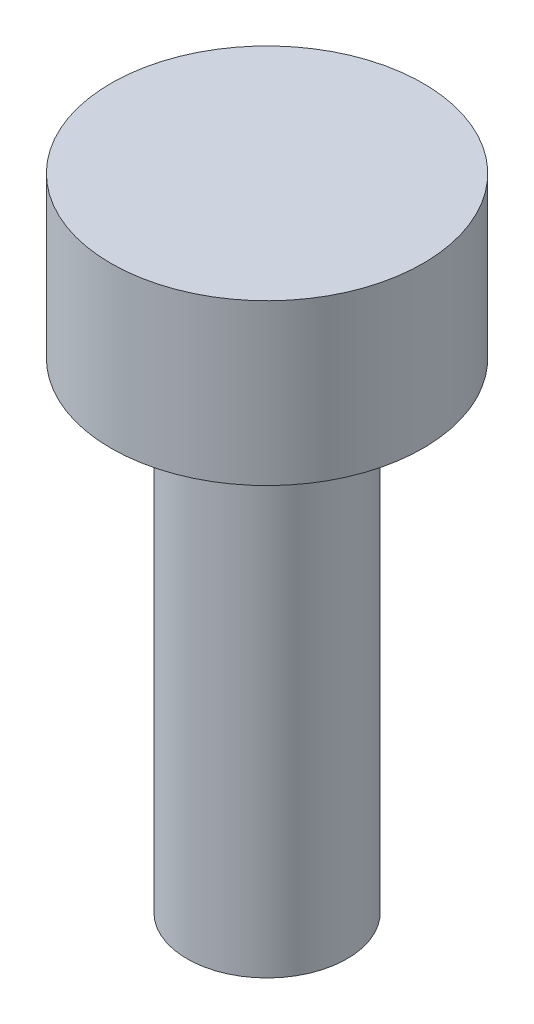
ISO-10303-21;
HEADER;
FILE_DESCRIPTION(('STEP AP214'),'2;1');
FILE_NAME('part.step','',(''),(''),'','','');
FILE_SCHEMA(('AUTOMOTIVE_DESIGN { 1 0 10303 214 1 1 1 1 }'));
ENDSEC;
DATA;
#1=APPLICATION_CONTEXT('core data for automotive mechanical design processes');
#2=APPLICATION_PROTOCOL_DEFINITION('international standard','automotive_design',2000,#1);
#3=PRODUCT_CONTEXT('',#1,'mechanical');
#4=PRODUCT('Part','Part','',(#3));
#5=PRODUCT_RELATED_PRODUCT_CATEGORY('part','',(#4));
#6=PRODUCT_DEFINITION_FORMATION('','',#4);
#7=PRODUCT_DEFINITION_CONTEXT('part definition',#1,'design');
#8=PRODUCT_DEFINITION('design','',#6,#7);
#9=PRODUCT_DEFINITION_SHAPE('','',#8);
#10=(LENGTH_UNIT() NAMED_UNIT(*) SI_UNIT(.MILLI.,.METRE.));
#11=(NAMED_UNIT(*) PLANE_ANGLE_UNIT() SI_UNIT($,.RADIAN.));
#12=(NAMED_UNIT(*) SI_UNIT($,.STERADIAN.) SOLID_ANGLE_UNIT());
#13=UNCERTAINTY_MEASURE_WITH_UNIT(LENGTH_MEASURE(1.E-05),#10,'distance_accuracy_value','');
#14=(GEOMETRIC_REPRESENTATION_CONTEXT(3) GLOBAL_UNCERTAINTY_ASSIGNED_CONTEXT((#13)) GLOBAL_UNIT_ASSIGNED_CONTEXT((#10,
#11,#12)) REPRESENTATION_CONTEXT('',''));
#15=CARTESIAN_POINT('',(0.,0.,0.));
#16=DIRECTION('',(0.,0.,1.));
#17=DIRECTION('',(1.,0.,0.));
#18=AXIS2_PLACEMENT_3D('',#15,#16,#17);
#19=CARTESIAN_POINT('',(0.,2.,0.));
#20=DIRECTION('',(0.,-1.,0.));
#21=DIRECTION('',(0.,0.,-1.));
#22=AXIS2_PLACEMENT_3D('',#19,#20,#21);
#23=CYLINDRICAL_SURFACE('',#22,1.95);
#24=CARTESIAN_POINT('',(0.,2.,0.));
#25=DIRECTION('',(0.,1.,0.));
#26=DIRECTION('',(0.,0.,1.));
#27=AXIS2_PLACEMENT_3D('',#24,#25,#26);
#28=CIRCLE('',#27,1.95);
#29=CARTESIAN_POINT('',(0.,2.,1.95));
#30=VERTEX_POINT('',#29);
#31=EDGE_CURVE('E49',#30,#30,#28,.T.);
#32=ORIENTED_EDGE('',*,*,#31,.F.);
#33=EDGE_LOOP('',(#32));
#34=FACE_BOUND('',#33,.T.);
#35=CARTESIAN_POINT('',(0.,0.,0.));
#36=DIRECTION('',(0.,1.,0.));
#37=DIRECTION('',(0.,0.,1.));
#38=AXIS2_PLACEMENT_3D('',#35,#36,#37);
#39=CIRCLE('',#38,1.95);
#40=CARTESIAN_POINT('',(0.,0.,1.95));
#41=VERTEX_POINT('',#40);
#42=EDGE_CURVE('E44',#41,#41,#39,.T.);
#43=ORIENTED_EDGE('',*,*,#42,.T.);
#44=EDGE_LOOP('',(#43));
#45=FACE_BOUND('',#44,.T.);
#46=ADVANCED_FACE('F41',(#34,#45),#23,.T.);
#47=CARTESIAN_POINT('',(0.,2.,0.));
#48=DIRECTION('',(0.,1.,0.));
#49=DIRECTION('',(0.,0.,1.));
#50=AXIS2_PLACEMENT_3D('',#47,#48,#49);
#51=PLANE('',#50);
#52=ORIENTED_EDGE('',*,*,#31,.T.);
#53=EDGE_LOOP('',(#52));
#54=FACE_BOUND('',#53,.T.);
#55=ADVANCED_FACE('F69',(#54),#51,.T.);
#56=CARTESIAN_POINT('',(0.,0.,0.));
#57=DIRECTION('',(0.,1.,0.));
#58=DIRECTION('',(0.,0.,1.));
#59=AXIS2_PLACEMENT_3D('',#56,#57,#58);
#60=PLANE('',#59);
#61=CARTESIAN_POINT('',(0.,0.,0.));
#62=DIRECTION('',(0.,-1.,0.));
#63=DIRECTION('',(0.,0.,-1.));
#64=AXIS2_PLACEMENT_3D('',#61,#62,#63);
#65=CIRCLE('',#64,1.);
#66=CARTESIAN_POINT('',(0.,0.,-1.));
#67=VERTEX_POINT('',#66);
#68=EDGE_CURVE('E10',#67,#67,#65,.T.);
#69=ORIENTED_EDGE('',*,*,#68,.F.);
#70=EDGE_LOOP('',(#69));
#71=FACE_BOUND('',#70,.T.);
#72=ORIENTED_EDGE('',*,*,#42,.F.);
#73=EDGE_LOOP('',(#72));
#74=FACE_BOUND('',#73,.T.);
#75=ADVANCED_FACE('F66',(#71,#74),#60,.F.);
#76=CARTESIAN_POINT('',(0.,-6.,0.));
#77=DIRECTION('',(0.,1.,0.));
#78=DIRECTION('',(0.,0.,1.));
#79=AXIS2_PLACEMENT_3D('',#76,#77,#78);
#80=CYLINDRICAL_SURFACE('',#79,1.);
#81=CARTESIAN_POINT('',(0.,-6.,0.));
#82=DIRECTION('',(0.,-1.,0.));
#83=DIRECTION('',(0.,0.,-1.));
#84=AXIS2_PLACEMENT_3D('',#81,#82,#83);
#85=CIRCLE('',#84,1.);
#86=CARTESIAN_POINT('',(0.,-6.,-1.));
#87=VERTEX_POINT('',#86);
#88=EDGE_CURVE('E56',#87,#87,#85,.T.);
#89=ORIENTED_EDGE('',*,*,#88,.F.);
#90=EDGE_LOOP('',(#89));
#91=FACE_BOUND('',#90,.T.);
#92=ORIENTED_EDGE('',*,*,#68,.T.);
#93=EDGE_LOOP('',(#92));
#94=FACE_BOUND('',#93,.T.);
#95=ADVANCED_FACE('F68',(#91,#94),#80,.T.);
#96=CARTESIAN_POINT('',(0.,-6.,0.));
#97=DIRECTION('',(0.,-1.,0.));
#98=DIRECTION('',(0.,0.,-1.));
#99=AXIS2_PLACEMENT_3D('',#96,#97,#98);
#100=PLANE('',#99);
#101=ORIENTED_EDGE('',*,*,#88,.T.);
#102=EDGE_LOOP('',(#101));
#103=FACE_BOUND('',#102,.T.);
#104=ADVANCED_FACE('F75',(#103),#100,.T.);
#105=CLOSED_SHELL('',(#46,#55,#75,#95,#104));
#106=MANIFOLD_SOLID_BREP('B2',#105);
#107=ADVANCED_BREP_SHAPE_REPRESENTATION('',(#18,#106),#14);
#108=SHAPE_DEFINITION_REPRESENTATION(#9,#107);
ENDSEC;
END-ISO-10303-21;
